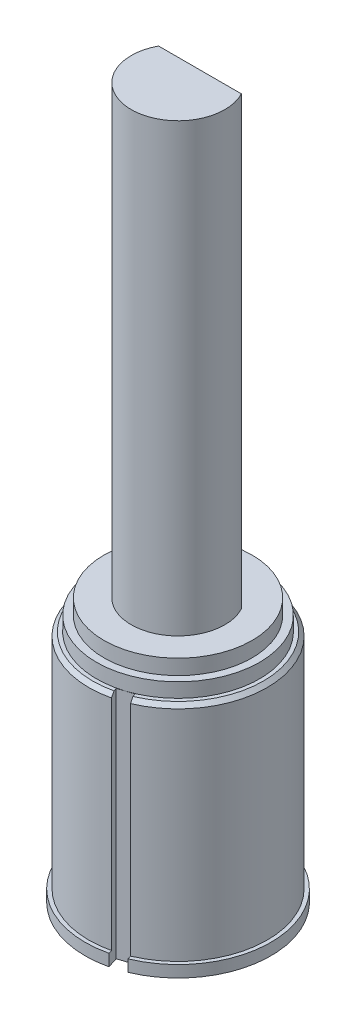
ISO-10303-21;
HEADER;
FILE_DESCRIPTION(('STEP AP214'),'2;1');
FILE_NAME('part.step','',(''),(''),'','','');
FILE_SCHEMA(('AUTOMOTIVE_DESIGN { 1 0 10303 214 1 1 1 1 }'));
ENDSEC;
DATA;
#1=APPLICATION_CONTEXT('core data for automotive mechanical design processes');
#2=APPLICATION_PROTOCOL_DEFINITION('international standard','automotive_design',2000,#1);
#3=PRODUCT_CONTEXT('',#1,'mechanical');
#4=PRODUCT('Part','Part','',(#3));
#5=PRODUCT_RELATED_PRODUCT_CATEGORY('part','',(#4));
#6=PRODUCT_DEFINITION_FORMATION('','',#4);
#7=PRODUCT_DEFINITION_CONTEXT('part definition',#1,'design');
#8=PRODUCT_DEFINITION('design','',#6,#7);
#9=PRODUCT_DEFINITION_SHAPE('','',#8);
#10=(LENGTH_UNIT() NAMED_UNIT(*) SI_UNIT(.MILLI.,.METRE.));
#11=(NAMED_UNIT(*) PLANE_ANGLE_UNIT() SI_UNIT($,.RADIAN.));
#12=(NAMED_UNIT(*) SI_UNIT($,.STERADIAN.) SOLID_ANGLE_UNIT());
#13=UNCERTAINTY_MEASURE_WITH_UNIT(LENGTH_MEASURE(1.E-05),#10,'distance_accuracy_value','');
#14=(GEOMETRIC_REPRESENTATION_CONTEXT(3) GLOBAL_UNCERTAINTY_ASSIGNED_CONTEXT((#13)) GLOBAL_UNIT_ASSIGNED_CONTEXT((#10,
#11,#12)) REPRESENTATION_CONTEXT('',''));
#15=CARTESIAN_POINT('',(0.,0.,0.));
#16=DIRECTION('',(0.,0.,1.));
#17=DIRECTION('',(1.,0.,0.));
#18=AXIS2_PLACEMENT_3D('',#15,#16,#17);
#19=CARTESIAN_POINT('',(0.,8.8646,0.));
#20=DIRECTION('',(0.,-1.,0.));
#21=DIRECTION('',(0.,0.,-1.));
#22=AXIS2_PLACEMENT_3D('',#19,#20,#21);
#23=CYLINDRICAL_SURFACE('',#22,1.5748);
#24=CARTESIAN_POINT('',(0.,23.8646,0.));
#25=DIRECTION('',(0.,1.,0.));
#26=DIRECTION('',(0.,0.,1.));
#27=AXIS2_PLACEMENT_3D('',#24,#25,#26);
#28=CIRCLE('',#27,1.5748);
#29=CARTESIAN_POINT('',(1.39191072989614,23.8646,-0.7366));
#30=VERTEX_POINT('',#29);
#31=CARTESIAN_POINT('',(-1.39191072989614,23.8646,-0.7366));
#32=VERTEX_POINT('',#31);
#33=EDGE_CURVE('E59',#30,#32,#28,.F.);
#34=ORIENTED_EDGE('',*,*,#33,.T.);
#35=DIRECTION('',(0.,-1.,0.));
#36=VECTOR('',#35,1.);
#37=CARTESIAN_POINT('',(-1.39191072989614,8.8646,-0.7366));
#38=LINE('',#37,#36);
#39=CARTESIAN_POINT('',(-1.39191072989614,8.8646,-0.7366));
#40=VERTEX_POINT('',#39);
#41=EDGE_CURVE('E171',#40,#32,#38,.F.);
#42=ORIENTED_EDGE('',*,*,#41,.F.);
#43=CARTESIAN_POINT('',(0.,8.8646,0.));
#44=DIRECTION('',(0.,-1.,0.));
#45=DIRECTION('',(0.,0.,-1.));
#46=AXIS2_PLACEMENT_3D('',#43,#44,#45);
#47=CIRCLE('',#46,1.5748);
#48=CARTESIAN_POINT('',(1.39191072989614,8.8646,-0.7366));
#49=VERTEX_POINT('',#48);
#50=EDGE_CURVE('E253',#49,#40,#47,.T.);
#51=ORIENTED_EDGE('',*,*,#50,.F.);
#52=DIRECTION('',(0.,-1.,0.));
#53=VECTOR('',#52,1.);
#54=CARTESIAN_POINT('',(1.39191072989614,8.8646,-0.7366));
#55=LINE('',#54,#53);
#56=EDGE_CURVE('E173',#30,#49,#55,.T.);
#57=ORIENTED_EDGE('',*,*,#56,.F.);
#58=EDGE_LOOP('',(#34,#42,#51,#57));
#59=FACE_BOUND('',#58,.T.);
#60=ADVANCED_FACE('F45',(#59),#23,.T.);
#61=CARTESIAN_POINT('',(-1.39191072989614,27.8638,-0.7366));
#62=DIRECTION('',(0.,0.,-1.));
#63=DIRECTION('',(-1.,0.,0.));
#64=AXIS2_PLACEMENT_3D('',#61,#62,#63);
#65=PLANE('',#64);
#66=ORIENTED_EDGE('',*,*,#41,.T.);
#67=DIRECTION('',(1.,0.,0.));
#68=VECTOR('',#67,1.);
#69=CARTESIAN_POINT('',(-1.39191072989614,23.8646,-0.7366));
#70=LINE('',#69,#68);
#71=EDGE_CURVE('E13',#32,#30,#70,.T.);
#72=ORIENTED_EDGE('',*,*,#71,.T.);
#73=ORIENTED_EDGE('',*,*,#56,.T.);
#74=DIRECTION('',(1.,0.,0.));
#75=VECTOR('',#74,1.);
#76=CARTESIAN_POINT('',(-1.39191072989614,8.8646,-0.7366));
#77=LINE('',#76,#75);
#78=EDGE_CURVE('E178',#40,#49,#77,.T.);
#79=ORIENTED_EDGE('',*,*,#78,.F.);
#80=EDGE_LOOP('',(#66,#72,#73,#79));
#81=FACE_BOUND('',#80,.T.);
#82=ADVANCED_FACE('F176',(#81),#65,.T.);
#83=CARTESIAN_POINT('',(0.,7.874,0.));
#84=DIRECTION('',(0.,-1.,0.));
#85=DIRECTION('',(0.,0.,-1.));
#86=AXIS2_PLACEMENT_3D('',#83,#84,#85);
#87=PLANE('',#86);
#88=CARTESIAN_POINT('',(0.,7.874,0.));
#89=DIRECTION('',(0.,-1.,0.));
#90=DIRECTION('',(0.,0.,-1.));
#91=AXIS2_PLACEMENT_3D('',#88,#89,#90);
#92=CIRCLE('',#91,2.7432);
#93=CARTESIAN_POINT('',(0.847695418969354,7.874,2.60893823550087));
#94=VERTEX_POINT('',#93);
#95=CARTESIAN_POINT('',(-2.72556496006896,7.874,-0.310550943396226));
#96=VERTEX_POINT('',#95);
#97=EDGE_CURVE('E183',#94,#96,#92,.F.);
#98=ORIENTED_EDGE('',*,*,#97,.F.);
#99=DIRECTION('',(-0.951056516295154,0.,0.309016994374947));
#100=VECTOR('',#99,1.);
#101=CARTESIAN_POINT('',(1.08926377410832,7.874,2.53044791892963));
#102=LINE('',#101,#100);
#103=CARTESIAN_POINT('',(1.08926377410832,7.874,2.53044791892963));
#104=VERTEX_POINT('',#103);
#105=EDGE_CURVE('E379',#104,#94,#102,.T.);
#106=ORIENTED_EDGE('',*,*,#105,.F.);
#107=DIRECTION('',(-0.309016994374947,0.,-0.951056516295154));
#108=VECTOR('',#107,1.);
#109=CARTESIAN_POINT('',(1.20699924896518,7.874,2.89280045163808));
#110=LINE('',#109,#108);
#111=CARTESIAN_POINT('',(1.12502908306406,7.874,2.64052222150469));
#112=VERTEX_POINT('',#111);
#113=EDGE_CURVE('E386',#112,#104,#110,.T.);
#114=ORIENTED_EDGE('',*,*,#113,.F.);
#115=CARTESIAN_POINT('',(0.,7.874,0.));
#116=DIRECTION('',(0.,-1.,0.));
#117=DIRECTION('',(0.,0.,-1.));
#118=AXIS2_PLACEMENT_3D('',#115,#116,#117);
#119=CIRCLE('',#118,2.8702);
#120=CARTESIAN_POINT('',(0.641892372786123,7.874,2.79750285464716));
#121=VERTEX_POINT('',#120);
#122=EDGE_CURVE('E323',#121,#112,#119,.T.);
#123=ORIENTED_EDGE('',*,*,#122,.F.);
#124=DIRECTION('',(0.309016994374947,0.,0.951056516295154));
#125=VECTOR('',#124,1.);
#126=CARTESIAN_POINT('',(0.606127063830387,7.874,2.6874285520721));
#127=LINE('',#126,#125);
#128=CARTESIAN_POINT('',(0.606127063830387,7.874,2.6874285520721));
#129=VERTEX_POINT('',#128);
#130=EDGE_CURVE('E377',#129,#121,#127,.T.);
#131=ORIENTED_EDGE('',*,*,#130,.F.);
#132=EDGE_CURVE('E174',#94,#129,#102,.T.);
#133=ORIENTED_EDGE('',*,*,#132,.F.);
#134=CARTESIAN_POINT('',(0.,7.874,0.));
#135=DIRECTION('',(0.,1.,0.));
#136=DIRECTION('',(1.,0.,0.));
#137=AXIS2_PLACEMENT_3D('',#134,#135,#136);
#138=CIRCLE('',#137,2.7432);
#139=CARTESIAN_POINT('',(-2.72556496006896,7.874,0.310550943396226));
#140=VERTEX_POINT('',#139);
#141=EDGE_CURVE('E258',#140,#94,#138,.T.);
#142=ORIENTED_EDGE('',*,*,#141,.F.);
#143=CARTESIAN_POINT('',(-2.6750915348825,7.874,0.304799999999999));
#144=DIRECTION('',(0.,1.,0.));
#145=DIRECTION('',(1.,0.,0.));
#146=AXIS2_PLACEMENT_3D('',#143,#144,#145);
#147=CIRCLE('',#146,0.0507999999999994);
#148=CARTESIAN_POINT('',(-2.6750915348825,7.874,0.254));
#149=VERTEX_POINT('',#148);
#150=EDGE_CURVE('E263',#149,#140,#147,.T.);
#151=ORIENTED_EDGE('',*,*,#150,.F.);
#152=DIRECTION('',(-1.,0.,0.));
#153=VECTOR('',#152,1.);
#154=CARTESIAN_POINT('',(-2.52164568486534,7.874,0.254));
#155=LINE('',#154,#153);
#156=CARTESIAN_POINT('',(-2.52164568486534,7.874,0.254));
#157=VERTEX_POINT('',#156);
#158=EDGE_CURVE('E291',#157,#149,#155,.T.);
#159=ORIENTED_EDGE('',*,*,#158,.F.);
#160=CARTESIAN_POINT('',(-2.52164568486534,7.874,0.3048));
#161=DIRECTION('',(0.,1.,0.));
#162=DIRECTION('',(1.,0.,0.));
#163=AXIS2_PLACEMENT_3D('',#160,#161,#162);
#164=CIRCLE('',#163,0.0507999999999997);
#165=CARTESIAN_POINT('',(-2.47121277116804,7.874,0.298703999999999));
#166=VERTEX_POINT('',#165);
#167=EDGE_CURVE('E288',#166,#157,#164,.T.);
#168=ORIENTED_EDGE('',*,*,#167,.F.);
#169=CARTESIAN_POINT('',(0.,7.874,0.));
#170=DIRECTION('',(0.,1.,0.));
#171=DIRECTION('',(1.,0.,0.));
#172=AXIS2_PLACEMENT_3D('',#169,#170,#171);
#173=CIRCLE('',#172,2.48919999999997);
#174=CARTESIAN_POINT('',(-2.47121277116803,7.874,-0.298704));
#175=VERTEX_POINT('',#174);
#176=EDGE_CURVE('E285',#175,#166,#173,.T.);
#177=ORIENTED_EDGE('',*,*,#176,.F.);
#178=CARTESIAN_POINT('',(-2.52164568486534,7.874,-0.3048));
#179=DIRECTION('',(0.,1.,0.));
#180=DIRECTION('',(1.,0.,0.));
#181=AXIS2_PLACEMENT_3D('',#178,#179,#180);
#182=CIRCLE('',#181,0.0508000000000004);
#183=CARTESIAN_POINT('',(-2.52164568486534,7.874,-0.254));
#184=VERTEX_POINT('',#183);
#185=EDGE_CURVE('E282',#184,#175,#182,.T.);
#186=ORIENTED_EDGE('',*,*,#185,.F.);
#187=DIRECTION('',(1.,0.,0.));
#188=VECTOR('',#187,1.);
#189=CARTESIAN_POINT('',(-2.6750915348825,7.874,-0.254));
#190=LINE('',#189,#188);
#191=CARTESIAN_POINT('',(-2.6750915348825,7.874,-0.254));
#192=VERTEX_POINT('',#191);
#193=EDGE_CURVE('E279',#192,#184,#190,.T.);
#194=ORIENTED_EDGE('',*,*,#193,.F.);
#195=CARTESIAN_POINT('',(-2.6750915348825,7.874,-0.304799999999999));
#196=DIRECTION('',(0.,1.,0.));
#197=DIRECTION('',(1.,0.,0.));
#198=AXIS2_PLACEMENT_3D('',#195,#196,#197);
#199=CIRCLE('',#198,0.0507999999999995);
#200=EDGE_CURVE('E276',#96,#192,#199,.T.);
#201=ORIENTED_EDGE('',*,*,#200,.F.);
#202=EDGE_LOOP('',(#98,#106,#114,#123,#131,#133,#142,#151,#159,#168,#177,#186,#194,#201));
#203=FACE_BOUND('',#202,.T.);
#204=ADVANCED_FACE('F47',(#203),#87,.F.);
#205=CARTESIAN_POINT('',(0.,7.874,0.));
#206=DIRECTION('',(0.,-1.,0.));
#207=DIRECTION('',(0.,0.,-1.));
#208=AXIS2_PLACEMENT_3D('',#205,#206,#207);
#209=CONICAL_SURFACE('',#208,2.8702,0.785398163397452);
#210=ORIENTED_EDGE('',*,*,#122,.T.);
#211=CARTESIAN_POINT('',(1.1249670362117,7.8742,2.64033126092865));
#212=CARTESIAN_POINT('',(1.13155377900542,7.85296841512401,2.66060317078848));
#213=CARTESIAN_POINT('',(1.13814025266243,7.83173595601895,2.6808742523307));
#214=CARTESIAN_POINT('',(1.15131266170257,7.78926928935229,2.72141475877847));
#215=CARTESIAN_POINT('',(1.15789859708569,7.76803508179067,2.741684183684));
#216=CARTESIAN_POINT('',(1.16448426333211,7.7468,2.76195278027194));
#217=B_SPLINE_CURVE_WITH_KNOTS('',3,(#211,#212,#213,#214,#215,#216),.UNSPECIFIED.,.F.,.F.,(4,2,
4),(0.,0.0902554226402187,0.180510845273843),.UNSPECIFIED.);
#218=CARTESIAN_POINT('',(1.1644222368144,7.747,2.76176188227952));
#219=VERTEX_POINT('',#218);
#220=EDGE_CURVE('E217',#112,#219,#217,.T.);
#221=ORIENTED_EDGE('',*,*,#220,.T.);
#222=CARTESIAN_POINT('',(0.,7.747,0.));
#223=DIRECTION('',(0.,-1.,0.));
#224=DIRECTION('',(0.,0.,-1.));
#225=AXIS2_PLACEMENT_3D('',#222,#223,#224);
#226=CIRCLE('',#225,2.9972);
#227=CARTESIAN_POINT('',(0.681285526536464,7.747,2.918742515422));
#228=VERTEX_POINT('',#227);
#229=EDGE_CURVE('E320',#228,#219,#226,.T.);
#230=ORIENTED_EDGE('',*,*,#229,.F.);
#231=CARTESIAN_POINT('',(0.68134755305417,7.7468,2.91893341341441));
#232=CARTESIAN_POINT('',(0.674761886807752,7.76803508179067,2.89866481682648));
#233=CARTESIAN_POINT('',(0.668175951424629,7.78926928935229,2.87839539192094));
#234=CARTESIAN_POINT('',(0.655003542384494,7.83173595601895,2.83785488547318));
#235=CARTESIAN_POINT('',(0.648417068727481,7.85296841512401,2.81758380393095));
#236=CARTESIAN_POINT('',(0.641830325933764,7.8742,2.79731189407112));
#237=B_SPLINE_CURVE_WITH_KNOTS('',3,(#231,#232,#233,#234,#235,#236),.UNSPECIFIED.,.F.,.F.,(4,2,
4),(0.,0.0902554226336243,0.180510845273843),.UNSPECIFIED.);
#238=EDGE_CURVE('E243',#228,#121,#237,.T.);
#239=ORIENTED_EDGE('',*,*,#238,.T.);
#240=EDGE_LOOP('',(#210,#221,#230,#239));
#241=FACE_BOUND('',#240,.T.);
#242=ADVANCED_FACE('F227',(#241),#209,.T.);
#243=CARTESIAN_POINT('',(0.,0.,0.));
#244=DIRECTION('',(0.,-1.,0.));
#245=DIRECTION('',(0.,0.,-1.));
#246=AXIS2_PLACEMENT_3D('',#243,#244,#245);
#247=CYLINDRICAL_SURFACE('',#246,2.9972);
#248=ORIENTED_EDGE('',*,*,#229,.T.);
#249=DIRECTION('',(0.,-1.,0.));
#250=VECTOR('',#249,1.);
#251=CARTESIAN_POINT('',(1.1644222368144,0.,2.76176188227952));
#252=LINE('',#251,#250);
#253=CARTESIAN_POINT('',(1.1644222368144,0.393700000000001,2.76176188227952));
#254=VERTEX_POINT('',#253);
#255=EDGE_CURVE('E209',#219,#254,#252,.T.);
#256=ORIENTED_EDGE('',*,*,#255,.T.);
#257=CARTESIAN_POINT('',(0.,0.393700000000001,0.));
#258=DIRECTION('',(0.,-1.,0.));
#259=DIRECTION('',(0.,0.,-1.));
#260=AXIS2_PLACEMENT_3D('',#257,#258,#259);
#261=CIRCLE('',#260,2.9972);
#262=CARTESIAN_POINT('',(0.681285526536464,0.393700000000001,2.918742515422));
#263=VERTEX_POINT('',#262);
#264=EDGE_CURVE('E317',#263,#254,#261,.T.);
#265=ORIENTED_EDGE('',*,*,#264,.F.);
#266=DIRECTION('',(0.,-1.,0.));
#267=VECTOR('',#266,1.);
#268=CARTESIAN_POINT('',(0.681285526536464,0.,2.918742515422));
#269=LINE('',#268,#267);
#270=EDGE_CURVE('E251',#263,#228,#269,.F.);
#271=ORIENTED_EDGE('',*,*,#270,.T.);
#272=EDGE_LOOP('',(#248,#256,#265,#271));
#273=FACE_BOUND('',#272,.T.);
#274=ADVANCED_FACE('F396',(#273),#247,.T.);
#275=CARTESIAN_POINT('',(2.9972,0.393700000000001,0.));
#276=DIRECTION('',(0.,-1.,0.));
#277=DIRECTION('',(0.,0.,-1.));
#278=AXIS2_PLACEMENT_3D('',#275,#276,#277);
#279=PLANE('',#278);
#280=ORIENTED_EDGE('',*,*,#264,.T.);
#281=DIRECTION('',(0.309016994374947,0.,0.951056516295154));
#282=VECTOR('',#281,1.);
#283=CARTESIAN_POINT('',(0.527775487368673,0.393700000000001,0.802364662514263));
#284=LINE('',#283,#282);
#285=CARTESIAN_POINT('',(1.20380329576346,0.3937,2.88296431908358));
#286=VERTEX_POINT('',#285);
#287=EDGE_CURVE('E206',#254,#286,#284,.T.);
#288=ORIENTED_EDGE('',*,*,#287,.T.);
#289=CARTESIAN_POINT('',(0.,0.3937,0.));
#290=DIRECTION('',(0.,-1.,0.));
#291=DIRECTION('',(0.,0.,-1.));
#292=AXIS2_PLACEMENT_3D('',#289,#290,#291);
#293=CIRCLE('',#292,3.1242);
#294=CARTESIAN_POINT('',(0.720666585485525,0.3937,3.03994495222605));
#295=VERTEX_POINT('',#294);
#296=EDGE_CURVE('E205',#295,#286,#293,.T.);
#297=ORIENTED_EDGE('',*,*,#296,.F.);
#298=DIRECTION('',(-0.309016994374947,0.,-0.951056516295154));
#299=VECTOR('',#298,1.);
#300=CARTESIAN_POINT('',(0.0446387770907347,0.393700000000001,0.959345295656736));
#301=LINE('',#300,#299);
#302=EDGE_CURVE('E392',#295,#263,#301,.T.);
#303=ORIENTED_EDGE('',*,*,#302,.T.);
#304=EDGE_LOOP('',(#280,#288,#297,#303));
#305=FACE_BOUND('',#304,.T.);
#306=ADVANCED_FACE('F435',(#305),#279,.F.);
#307=CARTESIAN_POINT('',(0.,0.,0.));
#308=DIRECTION('',(0.,-1.,0.));
#309=DIRECTION('',(0.,0.,-1.));
#310=AXIS2_PLACEMENT_3D('',#307,#308,#309);
#311=CYLINDRICAL_SURFACE('',#310,3.1242);
#312=ORIENTED_EDGE('',*,*,#296,.T.);
#313=DIRECTION('',(0.,-1.,0.));
#314=VECTOR('',#313,1.);
#315=CARTESIAN_POINT('',(1.20380329576346,0.,2.88296431908358));
#316=LINE('',#315,#314);
#317=CARTESIAN_POINT('',(1.20380329576346,0.,2.88296431908358));
#318=VERTEX_POINT('',#317);
#319=EDGE_CURVE('E197',#286,#318,#316,.T.);
#320=ORIENTED_EDGE('',*,*,#319,.T.);
#321=CARTESIAN_POINT('',(0.,0.,0.));
#322=DIRECTION('',(0.,-1.,0.));
#323=DIRECTION('',(0.,0.,-1.));
#324=AXIS2_PLACEMENT_3D('',#321,#322,#323);
#325=CIRCLE('',#324,3.1242);
#326=CARTESIAN_POINT('',(0.720666585485525,0.,3.03994495222605));
#327=VERTEX_POINT('',#326);
#328=EDGE_CURVE('E193',#327,#318,#325,.T.);
#329=ORIENTED_EDGE('',*,*,#328,.F.);
#330=DIRECTION('',(0.,-1.,0.));
#331=VECTOR('',#330,1.);
#332=CARTESIAN_POINT('',(0.720666585485525,0.,3.03994495222605));
#333=LINE('',#332,#331);
#334=EDGE_CURVE('E225',#327,#295,#333,.F.);
#335=ORIENTED_EDGE('',*,*,#334,.T.);
#336=EDGE_LOOP('',(#312,#320,#329,#335));
#337=FACE_BOUND('',#336,.T.);
#338=ADVANCED_FACE('F202',(#337),#311,.T.);
#339=CARTESIAN_POINT('',(3.1242,0.,0.));
#340=DIRECTION('',(0.,1.,0.));
#341=DIRECTION('',(0.,0.,1.));
#342=AXIS2_PLACEMENT_3D('',#339,#340,#341);
#343=PLANE('',#342);
#344=DIRECTION('',(-0.951056516295154,0.,0.309016994374947));
#345=VECTOR('',#344,1.);
#346=CARTESIAN_POINT('',(1.08926377410832,0.,2.53044791892963));
#347=LINE('',#346,#345);
#348=CARTESIAN_POINT('',(1.08926377410832,0.,2.53044791892963));
#349=VERTEX_POINT('',#348);
#350=CARTESIAN_POINT('',(0.606127063830387,0.,2.6874285520721));
#351=VERTEX_POINT('',#350);
#352=EDGE_CURVE('E66',#349,#351,#347,.T.);
#353=ORIENTED_EDGE('',*,*,#352,.T.);
#354=DIRECTION('',(0.309016994374947,0.,0.951056516295154));
#355=VECTOR('',#354,1.);
#356=CARTESIAN_POINT('',(0.606127063830387,0.,2.6874285520721));
#357=LINE('',#356,#355);
#358=EDGE_CURVE('E383',#351,#327,#357,.T.);
#359=ORIENTED_EDGE('',*,*,#358,.T.);
#360=ORIENTED_EDGE('',*,*,#328,.T.);
#361=DIRECTION('',(-0.309016994374947,0.,-0.951056516295154));
#362=VECTOR('',#361,1.);
#363=CARTESIAN_POINT('',(0.539902908225864,0.,0.839689026034835));
#364=LINE('',#363,#362);
#365=EDGE_CURVE('E53',#318,#349,#364,.T.);
#366=ORIENTED_EDGE('',*,*,#365,.T.);
#367=EDGE_LOOP('',(#353,#359,#360,#366));
#368=FACE_BOUND('',#367,.T.);
#369=ADVANCED_FACE('F191',(#368),#343,.F.);
#370=CARTESIAN_POINT('',(0.,8.3566,0.));
#371=DIRECTION('',(0.,-1.,0.));
#372=DIRECTION('',(0.,0.,-1.));
#373=AXIS2_PLACEMENT_3D('',#370,#371,#372);
#374=CYLINDRICAL_SURFACE('',#373,2.7432);
#375=ORIENTED_EDGE('',*,*,#141,.T.);
#376=ORIENTED_EDGE('',*,*,#97,.T.);
#377=DIRECTION('',(0.,-1.,0.));
#378=VECTOR('',#377,1.);
#379=CARTESIAN_POINT('',(-2.72556496006896,8.3566,-0.310550943396226));
#380=LINE('',#379,#378);
#381=CARTESIAN_POINT('',(-2.72556496006896,8.3566,-0.310550943396226));
#382=VERTEX_POINT('',#381);
#383=EDGE_CURVE('E312',#382,#96,#380,.T.);
#384=ORIENTED_EDGE('',*,*,#383,.F.);
#385=CARTESIAN_POINT('',(0.,8.3566,0.));
#386=DIRECTION('',(0.,1.,0.));
#387=DIRECTION('',(1.,0.,0.));
#388=AXIS2_PLACEMENT_3D('',#385,#386,#387);
#389=CIRCLE('',#388,2.7432);
#390=CARTESIAN_POINT('',(-2.72556496006896,8.3566,0.310550943396226));
#391=VERTEX_POINT('',#390);
#392=EDGE_CURVE('E259',#391,#382,#389,.T.);
#393=ORIENTED_EDGE('',*,*,#392,.F.);
#394=DIRECTION('',(0.,-1.,0.));
#395=VECTOR('',#394,1.);
#396=CARTESIAN_POINT('',(-2.72556496006896,8.3566,0.310550943396226));
#397=LINE('',#396,#395);
#398=EDGE_CURVE('E273',#391,#140,#397,.T.);
#399=ORIENTED_EDGE('',*,*,#398,.T.);
#400=EDGE_LOOP('',(#375,#376,#384,#393,#399));
#401=FACE_BOUND('',#400,.T.);
#402=ADVANCED_FACE('F366',(#401),#374,.T.);
#403=CARTESIAN_POINT('',(-2.6750915348825,8.3566,-0.304799999999999));
#404=DIRECTION('',(0.,-1.,0.));
#405=DIRECTION('',(0.,0.,-1.));
#406=AXIS2_PLACEMENT_3D('',#403,#404,#405);
#407=CYLINDRICAL_SURFACE('',#406,0.0507999999999995);
#408=ORIENTED_EDGE('',*,*,#200,.T.);
#409=DIRECTION('',(0.,-1.,0.));
#410=VECTOR('',#409,1.);
#411=CARTESIAN_POINT('',(-2.6750915348825,8.3566,-0.254));
#412=LINE('',#411,#410);
#413=CARTESIAN_POINT('',(-2.6750915348825,8.3566,-0.254));
#414=VERTEX_POINT('',#413);
#415=EDGE_CURVE('E308',#414,#192,#412,.T.);
#416=ORIENTED_EDGE('',*,*,#415,.F.);
#417=CARTESIAN_POINT('',(-2.6750915348825,8.3566,-0.304799999999999));
#418=DIRECTION('',(0.,1.,0.));
#419=DIRECTION('',(1.,0.,0.));
#420=AXIS2_PLACEMENT_3D('',#417,#418,#419);
#421=CIRCLE('',#420,0.0507999999999995);
#422=EDGE_CURVE('E262',#382,#414,#421,.T.);
#423=ORIENTED_EDGE('',*,*,#422,.F.);
#424=ORIENTED_EDGE('',*,*,#383,.T.);
#425=EDGE_LOOP('',(#408,#416,#423,#424));
#426=FACE_BOUND('',#425,.T.);
#427=ADVANCED_FACE('F368',(#426),#407,.T.);
#428=CARTESIAN_POINT('',(-2.6750915348825,8.3566,-0.254));
#429=DIRECTION('',(0.,0.,-1.));
#430=DIRECTION('',(-1.,0.,0.));
#431=AXIS2_PLACEMENT_3D('',#428,#429,#430);
#432=PLANE('',#431);
#433=ORIENTED_EDGE('',*,*,#193,.T.);
#434=DIRECTION('',(0.,-1.,0.));
#435=VECTOR('',#434,1.);
#436=CARTESIAN_POINT('',(-2.52164568486534,8.3566,-0.254));
#437=LINE('',#436,#435);
#438=CARTESIAN_POINT('',(-2.52164568486534,8.3566,-0.254));
#439=VERTEX_POINT('',#438);
#440=EDGE_CURVE('E305',#439,#184,#437,.T.);
#441=ORIENTED_EDGE('',*,*,#440,.F.);
#442=DIRECTION('',(1.,0.,0.));
#443=VECTOR('',#442,1.);
#444=CARTESIAN_POINT('',(-2.6750915348825,8.3566,-0.254));
#445=LINE('',#444,#443);
#446=EDGE_CURVE('E265',#414,#439,#445,.T.);
#447=ORIENTED_EDGE('',*,*,#446,.F.);
#448=ORIENTED_EDGE('',*,*,#415,.T.);
#449=EDGE_LOOP('',(#433,#441,#447,#448));
#450=FACE_BOUND('',#449,.T.);
#451=ADVANCED_FACE('F371',(#450),#432,.F.);
#452=CARTESIAN_POINT('',(-2.52164568486534,8.3566,-0.3048));
#453=DIRECTION('',(0.,-1.,0.));
#454=DIRECTION('',(0.,0.,-1.));
#455=AXIS2_PLACEMENT_3D('',#452,#453,#454);
#456=CYLINDRICAL_SURFACE('',#455,0.0508000000000004);
#457=ORIENTED_EDGE('',*,*,#185,.T.);
#458=DIRECTION('',(0.,-1.,0.));
#459=VECTOR('',#458,1.);
#460=CARTESIAN_POINT('',(-2.47121277116803,8.3566,-0.298704));
#461=LINE('',#460,#459);
#462=CARTESIAN_POINT('',(-2.47121277116803,8.3566,-0.298704));
#463=VERTEX_POINT('',#462);
#464=EDGE_CURVE('E309',#463,#175,#461,.T.);
#465=ORIENTED_EDGE('',*,*,#464,.F.);
#466=CARTESIAN_POINT('',(-2.52164568486534,8.3566,-0.3048));
#467=DIRECTION('',(0.,1.,0.));
#468=DIRECTION('',(1.,0.,0.));
#469=AXIS2_PLACEMENT_3D('',#466,#467,#468);
#470=CIRCLE('',#469,0.0508000000000004);
#471=EDGE_CURVE('E267',#439,#463,#470,.T.);
#472=ORIENTED_EDGE('',*,*,#471,.F.);
#473=ORIENTED_EDGE('',*,*,#440,.T.);
#474=EDGE_LOOP('',(#457,#465,#472,#473));
#475=FACE_BOUND('',#474,.T.);
#476=ADVANCED_FACE('F372',(#475),#456,.T.);
#477=CARTESIAN_POINT('',(0.,8.3566,0.));
#478=DIRECTION('',(0.,-1.,0.));
#479=DIRECTION('',(0.,0.,-1.));
#480=AXIS2_PLACEMENT_3D('',#477,#478,#479);
#481=CYLINDRICAL_SURFACE('',#480,2.48919999999997);
#482=ORIENTED_EDGE('',*,*,#176,.T.);
#483=DIRECTION('',(0.,-1.,0.));
#484=VECTOR('',#483,1.);
#485=CARTESIAN_POINT('',(-2.47121277116804,8.3566,0.298703999999999));
#486=LINE('',#485,#484);
#487=CARTESIAN_POINT('',(-2.47121277116804,8.3566,0.298703999999999));
#488=VERTEX_POINT('',#487);
#489=EDGE_CURVE('E304',#488,#166,#486,.T.);
#490=ORIENTED_EDGE('',*,*,#489,.F.);
#491=CARTESIAN_POINT('',(0.,8.3566,0.));
#492=DIRECTION('',(0.,1.,0.));
#493=DIRECTION('',(1.,0.,0.));
#494=AXIS2_PLACEMENT_3D('',#491,#492,#493);
#495=CIRCLE('',#494,2.4892);
#496=EDGE_CURVE('E179',#488,#463,#495,.T.);
#497=ORIENTED_EDGE('',*,*,#496,.T.);
#498=ORIENTED_EDGE('',*,*,#464,.T.);
#499=EDGE_LOOP('',(#482,#490,#497,#498));
#500=FACE_BOUND('',#499,.T.);
#501=CARTESIAN_POINT('',(0.,8.8646,0.));
#502=DIRECTION('',(0.,1.,0.));
#503=DIRECTION('',(1.,0.,0.));
#504=AXIS2_PLACEMENT_3D('',#501,#502,#503);
#505=CIRCLE('',#504,2.4892);
#506=CARTESIAN_POINT('',(2.4892,8.8646,0.));
#507=VERTEX_POINT('',#506);
#508=EDGE_CURVE('E255',#507,#507,#505,.T.);
#509=ORIENTED_EDGE('',*,*,#508,.F.);
#510=EDGE_LOOP('',(#509));
#511=FACE_BOUND('',#510,.T.);
#512=ADVANCED_FACE('F351',(#500,#511),#481,.T.);
#513=CARTESIAN_POINT('',(-2.52164568486534,8.3566,0.3048));
#514=DIRECTION('',(0.,-1.,0.));
#515=DIRECTION('',(0.,0.,-1.));
#516=AXIS2_PLACEMENT_3D('',#513,#514,#515);
#517=CYLINDRICAL_SURFACE('',#516,0.0507999999999997);
#518=ORIENTED_EDGE('',*,*,#167,.T.);
#519=DIRECTION('',(0.,-1.,0.));
#520=VECTOR('',#519,1.);
#521=CARTESIAN_POINT('',(-2.52164568486534,8.3566,0.254));
#522=LINE('',#521,#520);
#523=CARTESIAN_POINT('',(-2.52164568486534,8.3566,0.254));
#524=VERTEX_POINT('',#523);
#525=EDGE_CURVE('E301',#524,#157,#522,.T.);
#526=ORIENTED_EDGE('',*,*,#525,.F.);
#527=CARTESIAN_POINT('',(-2.52164568486534,8.3566,0.3048));
#528=DIRECTION('',(0.,1.,0.));
#529=DIRECTION('',(1.,0.,0.));
#530=AXIS2_PLACEMENT_3D('',#527,#528,#529);
#531=CIRCLE('',#530,0.0507999999999997);
#532=EDGE_CURVE('E271',#488,#524,#531,.T.);
#533=ORIENTED_EDGE('',*,*,#532,.F.);
#534=ORIENTED_EDGE('',*,*,#489,.T.);
#535=EDGE_LOOP('',(#518,#526,#533,#534));
#536=FACE_BOUND('',#535,.T.);
#537=ADVANCED_FACE('F354',(#536),#517,.T.);
#538=CARTESIAN_POINT('',(-2.52164568486534,8.3566,0.254));
#539=DIRECTION('',(0.,0.,1.));
#540=DIRECTION('',(1.,0.,0.));
#541=AXIS2_PLACEMENT_3D('',#538,#539,#540);
#542=PLANE('',#541);
#543=ORIENTED_EDGE('',*,*,#158,.T.);
#544=DIRECTION('',(0.,-1.,0.));
#545=VECTOR('',#544,1.);
#546=CARTESIAN_POINT('',(-2.6750915348825,8.3566,0.254));
#547=LINE('',#546,#545);
#548=CARTESIAN_POINT('',(-2.6750915348825,8.3566,0.254));
#549=VERTEX_POINT('',#548);
#550=EDGE_CURVE('E298',#549,#149,#547,.T.);
#551=ORIENTED_EDGE('',*,*,#550,.F.);
#552=DIRECTION('',(-1.,0.,0.));
#553=VECTOR('',#552,1.);
#554=CARTESIAN_POINT('',(-2.52164568486534,8.3566,0.254));
#555=LINE('',#554,#553);
#556=EDGE_CURVE('E268',#524,#549,#555,.T.);
#557=ORIENTED_EDGE('',*,*,#556,.F.);
#558=ORIENTED_EDGE('',*,*,#525,.T.);
#559=EDGE_LOOP('',(#543,#551,#557,#558));
#560=FACE_BOUND('',#559,.T.);
#561=ADVANCED_FACE('F358',(#560),#542,.F.);
#562=CARTESIAN_POINT('',(-2.6750915348825,8.3566,0.304799999999999));
#563=DIRECTION('',(0.,-1.,0.));
#564=DIRECTION('',(0.,0.,-1.));
#565=AXIS2_PLACEMENT_3D('',#562,#563,#564);
#566=CYLINDRICAL_SURFACE('',#565,0.0507999999999994);
#567=ORIENTED_EDGE('',*,*,#150,.T.);
#568=ORIENTED_EDGE('',*,*,#398,.F.);
#569=CARTESIAN_POINT('',(-2.6750915348825,8.3566,0.304799999999999));
#570=DIRECTION('',(0.,1.,0.));
#571=DIRECTION('',(1.,0.,0.));
#572=AXIS2_PLACEMENT_3D('',#569,#570,#571);
#573=CIRCLE('',#572,0.0507999999999994);
#574=EDGE_CURVE('E270',#549,#391,#573,.T.);
#575=ORIENTED_EDGE('',*,*,#574,.F.);
#576=ORIENTED_EDGE('',*,*,#550,.T.);
#577=EDGE_LOOP('',(#567,#568,#575,#576));
#578=FACE_BOUND('',#577,.T.);
#579=ADVANCED_FACE('F364',(#578),#566,.T.);
#580=CARTESIAN_POINT('',(0.,8.3566,0.));
#581=DIRECTION('',(0.,1.,0.));
#582=DIRECTION('',(0.,0.,1.));
#583=AXIS2_PLACEMENT_3D('',#580,#581,#582);
#584=PLANE('',#583);
#585=ORIENTED_EDGE('',*,*,#496,.F.);
#586=ORIENTED_EDGE('',*,*,#532,.T.);
#587=ORIENTED_EDGE('',*,*,#556,.T.);
#588=ORIENTED_EDGE('',*,*,#574,.T.);
#589=ORIENTED_EDGE('',*,*,#392,.T.);
#590=ORIENTED_EDGE('',*,*,#422,.T.);
#591=ORIENTED_EDGE('',*,*,#446,.T.);
#592=ORIENTED_EDGE('',*,*,#471,.T.);
#593=EDGE_LOOP('',(#585,#586,#587,#588,#589,#590,#591,#592));
#594=FACE_BOUND('',#593,.T.);
#595=ADVANCED_FACE('F344',(#594),#584,.T.);
#596=CARTESIAN_POINT('',(0.,8.8646,0.));
#597=DIRECTION('',(0.,1.,0.));
#598=DIRECTION('',(0.,0.,1.));
#599=AXIS2_PLACEMENT_3D('',#596,#597,#598);
#600=PLANE('',#599);
#601=ORIENTED_EDGE('',*,*,#50,.T.);
#602=ORIENTED_EDGE('',*,*,#78,.T.);
#603=EDGE_LOOP('',(#601,#602));
#604=FACE_BOUND('',#603,.T.);
#605=ORIENTED_EDGE('',*,*,#508,.T.);
#606=EDGE_LOOP('',(#605));
#607=FACE_BOUND('',#606,.T.);
#608=ADVANCED_FACE('F239',(#604,#607),#600,.T.);
#609=CARTESIAN_POINT('',(0.606127063830387,0.,2.6874285520721));
#610=DIRECTION('',(-0.951056516295154,0.,0.309016994374947));
#611=DIRECTION('',(0.309016994374947,0.,0.951056516295154));
#612=AXIS2_PLACEMENT_3D('',#609,#610,#611);
#613=PLANE('',#612);
#614=ORIENTED_EDGE('',*,*,#270,.F.);
#615=ORIENTED_EDGE('',*,*,#302,.F.);
#616=ORIENTED_EDGE('',*,*,#334,.F.);
#617=ORIENTED_EDGE('',*,*,#358,.F.);
#618=DIRECTION('',(0.,1.,0.));
#619=VECTOR('',#618,1.);
#620=CARTESIAN_POINT('',(0.606127063830387,0.,2.6874285520721));
#621=LINE('',#620,#619);
#622=EDGE_CURVE('E207',#351,#129,#621,.T.);
#623=ORIENTED_EDGE('',*,*,#622,.T.);
#624=ORIENTED_EDGE('',*,*,#130,.T.);
#625=ORIENTED_EDGE('',*,*,#238,.F.);
#626=EDGE_LOOP('',(#614,#615,#616,#617,#623,#624,#625));
#627=FACE_BOUND('',#626,.T.);
#628=ADVANCED_FACE('F235',(#627),#613,.F.);
#629=CARTESIAN_POINT('',(1.20699924896518,0.,2.89280045163808));
#630=DIRECTION('',(0.951056516295154,0.,-0.309016994374947));
#631=DIRECTION('',(-0.309016994374947,0.,-0.951056516295154));
#632=AXIS2_PLACEMENT_3D('',#629,#630,#631);
#633=PLANE('',#632);
#634=ORIENTED_EDGE('',*,*,#113,.T.);
#635=DIRECTION('',(0.,1.,0.));
#636=VECTOR('',#635,1.);
#637=CARTESIAN_POINT('',(1.08926377410832,0.,2.53044791892963));
#638=LINE('',#637,#636);
#639=EDGE_CURVE('E199',#349,#104,#638,.T.);
#640=ORIENTED_EDGE('',*,*,#639,.F.);
#641=ORIENTED_EDGE('',*,*,#365,.F.);
#642=ORIENTED_EDGE('',*,*,#319,.F.);
#643=ORIENTED_EDGE('',*,*,#287,.F.);
#644=ORIENTED_EDGE('',*,*,#255,.F.);
#645=ORIENTED_EDGE('',*,*,#220,.F.);
#646=EDGE_LOOP('',(#634,#640,#641,#642,#643,#644,#645));
#647=FACE_BOUND('',#646,.T.);
#648=ADVANCED_FACE('F196',(#647),#633,.F.);
#649=CARTESIAN_POINT('',(1.08926377410832,0.,2.53044791892963));
#650=DIRECTION('',(-0.309016994374947,0.,-0.951056516295154));
#651=DIRECTION('',(-0.951056516295154,0.,0.309016994374947));
#652=AXIS2_PLACEMENT_3D('',#649,#650,#651);
#653=PLANE('',#652);
#654=ORIENTED_EDGE('',*,*,#105,.T.);
#655=ORIENTED_EDGE('',*,*,#132,.T.);
#656=ORIENTED_EDGE('',*,*,#622,.F.);
#657=ORIENTED_EDGE('',*,*,#352,.F.);
#658=ORIENTED_EDGE('',*,*,#639,.T.);
#659=EDGE_LOOP('',(#654,#655,#656,#657,#658));
#660=FACE_BOUND('',#659,.T.);
#661=ADVANCED_FACE('F234',(#660),#653,.F.);
#662=CARTESIAN_POINT('',(0.,23.8646,0.));
#663=DIRECTION('',(0.,1.,0.));
#664=DIRECTION('',(0.,0.,1.));
#665=AXIS2_PLACEMENT_3D('',#662,#663,#664);
#666=PLANE('',#665);
#667=ORIENTED_EDGE('',*,*,#33,.F.);
#668=ORIENTED_EDGE('',*,*,#71,.F.);
#669=EDGE_LOOP('',(#667,#668));
#670=FACE_BOUND('',#669,.T.);
#671=ADVANCED_FACE('F164',(#670),#666,.T.);
#672=CLOSED_SHELL('',(#60,#82,#204,#242,#274,#306,#338,#369,#402,#427,#451,#476,#512,#537,#561,
#579,#595,#608,#628,#648,#661,#671));
#673=MANIFOLD_SOLID_BREP('B2',#672);
#674=ADVANCED_BREP_SHAPE_REPRESENTATION('',(#18,#673),#14);
#675=SHAPE_DEFINITION_REPRESENTATION(#9,#674);
ENDSEC;
END-ISO-10303-21;
